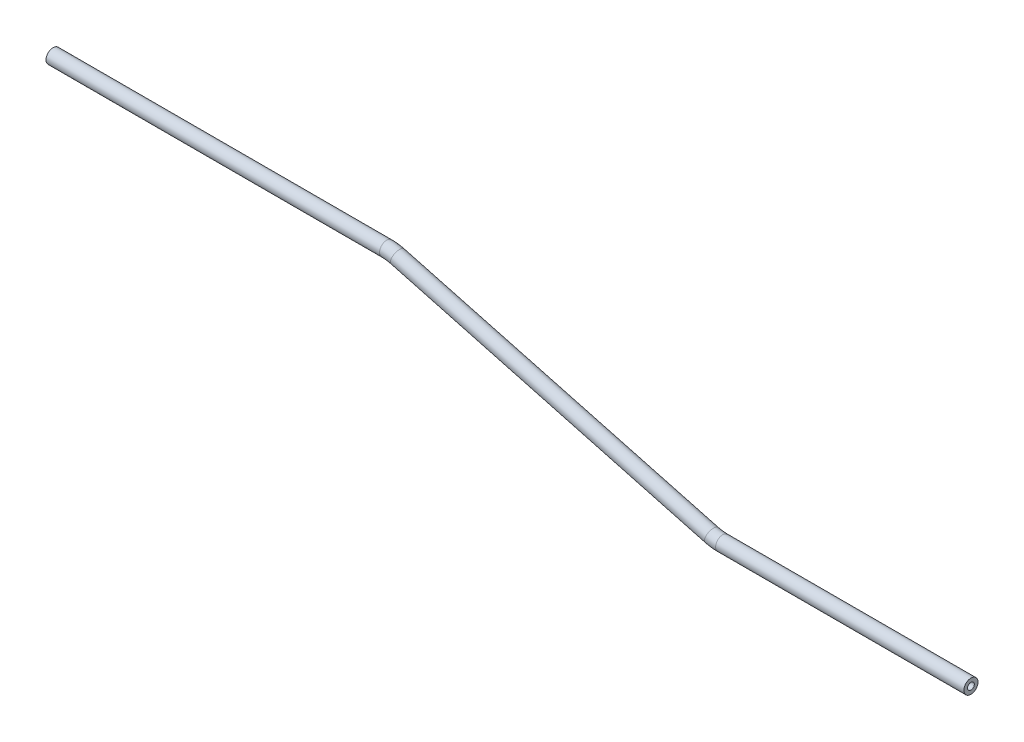
ISO-10303-21;
HEADER;
FILE_DESCRIPTION(('STEP AP214'),'2;1');
FILE_NAME('part.step','',(''),(''),'','','');
FILE_SCHEMA(('AUTOMOTIVE_DESIGN { 1 0 10303 214 1 1 1 1 }'));
ENDSEC;
DATA;
#1=APPLICATION_CONTEXT('core data for automotive mechanical design processes');
#2=APPLICATION_PROTOCOL_DEFINITION('international standard','automotive_design',2000,#1);
#3=PRODUCT_CONTEXT('',#1,'mechanical');
#4=PRODUCT('Part','Part','',(#3));
#5=PRODUCT_RELATED_PRODUCT_CATEGORY('part','',(#4));
#6=PRODUCT_DEFINITION_FORMATION('','',#4);
#7=PRODUCT_DEFINITION_CONTEXT('part definition',#1,'design');
#8=PRODUCT_DEFINITION('design','',#6,#7);
#9=PRODUCT_DEFINITION_SHAPE('','',#8);
#10=(LENGTH_UNIT() NAMED_UNIT(*) SI_UNIT(.MILLI.,.METRE.));
#11=(NAMED_UNIT(*) PLANE_ANGLE_UNIT() SI_UNIT($,.RADIAN.));
#12=(NAMED_UNIT(*) SI_UNIT($,.STERADIAN.) SOLID_ANGLE_UNIT());
#13=UNCERTAINTY_MEASURE_WITH_UNIT(LENGTH_MEASURE(1.E-05),#10,'distance_accuracy_value','');
#14=(GEOMETRIC_REPRESENTATION_CONTEXT(3) GLOBAL_UNCERTAINTY_ASSIGNED_CONTEXT((#13)) GLOBAL_UNIT_ASSIGNED_CONTEXT((#10,
#11,#12)) REPRESENTATION_CONTEXT('',''));
#15=CARTESIAN_POINT('',(0.,0.,0.));
#16=DIRECTION('',(0.,0.,1.));
#17=DIRECTION('',(1.,0.,0.));
#18=AXIS2_PLACEMENT_3D('',#15,#16,#17);
#19=CARTESIAN_POINT('',(-134.955757404131,7.1637583532924,0.));
#20=DIRECTION('',(1.,0.,0.));
#21=DIRECTION('',(0.,1.,0.));
#22=AXIS2_PLACEMENT_3D('',#19,#20,#21);
#23=CYLINDRICAL_SURFACE('',#22,3.175);
#24=CARTESIAN_POINT('',(14.9362625168288,7.16375835329244,0.));
#25=DIRECTION('',(1.,0.,0.));
#26=DIRECTION('',(0.,1.,0.));
#27=AXIS2_PLACEMENT_3D('',#24,#25,#26);
#28=CIRCLE('',#27,3.175);
#29=CARTESIAN_POINT('',(14.9362625168288,10.3387583532924,0.));
#30=VERTEX_POINT('',#29);
#31=EDGE_CURVE('E54',#30,#30,#28,.T.);
#32=ORIENTED_EDGE('',*,*,#31,.F.);
#33=EDGE_LOOP('',(#32));
#34=FACE_BOUND('',#33,.T.);
#35=CARTESIAN_POINT('',(-134.955757404131,7.1637583532924,0.));
#36=DIRECTION('',(1.,0.,0.));
#37=DIRECTION('',(0.,1.,0.));
#38=AXIS2_PLACEMENT_3D('',#35,#36,#37);
#39=CIRCLE('',#38,3.175);
#40=CARTESIAN_POINT('',(-134.955757404131,10.3387583532924,0.));
#41=VERTEX_POINT('',#40);
#42=EDGE_CURVE('E51',#41,#41,#39,.T.);
#43=ORIENTED_EDGE('',*,*,#42,.T.);
#44=EDGE_LOOP('',(#43));
#45=FACE_BOUND('',#44,.T.);
#46=ADVANCED_FACE('F30',(#34,#45),#23,.T.);
#47=CARTESIAN_POINT('',(14.9362625168288,-11.8862416467076,0.));
#48=DIRECTION('',(0.,0.,-1.));
#49=DIRECTION('',(-1.,0.,0.));
#50=AXIS2_PLACEMENT_3D('',#47,#48,#49);
#51=TOROIDAL_SURFACE('',#50,19.05,3.175);
#52=CARTESIAN_POINT('',(19.8667653260318,6.51464534409918,0.));
#53=DIRECTION('',(0.965925826289068,-0.258819045102521,0.));
#54=DIRECTION('',(0.258819045102521,0.965925826289068,0.));
#55=AXIS2_PLACEMENT_3D('',#52,#53,#54);
#56=CIRCLE('',#55,3.175);
#57=CARTESIAN_POINT('',(20.6885157942323,9.58145984256696,0.));
#58=VERTEX_POINT('',#57);
#59=EDGE_CURVE('E57',#58,#58,#56,.T.);
#60=CARTESIAN_POINT('',(14.9362625168288,-11.8862416467076,0.));
#61=DIRECTION('',(0.,0.,-1.));
#62=DIRECTION('',(-1.,0.,0.));
#63=AXIS2_PLACEMENT_3D('',#60,#61,#62);
#64=CIRCLE('',#63,22.225);
#65=EDGE_CURVE('',#30,#58,#64,.T.);
#66=ORIENTED_EDGE('',*,*,#31,.T.);
#67=ORIENTED_EDGE('',*,*,#59,.F.);
#68=ORIENTED_EDGE('',*,*,#65,.T.);
#69=ORIENTED_EDGE('',*,*,#65,.F.);
#70=EDGE_LOOP('',(#66,#68,#67,#69));
#71=FACE_BOUND('',#70,.T.);
#72=ADVANCED_FACE('F76',(#71),#51,.T.);
#73=CARTESIAN_POINT('',(19.8667653260319,6.51464534409919,0.));
#74=DIRECTION('',(0.965925826289068,-0.258819045102521,0.));
#75=DIRECTION('',(0.258819045102521,0.965925826289068,0.));
#76=AXIS2_PLACEMENT_3D('',#73,#74,#75);
#77=CYLINDRICAL_SURFACE('',#76,3.175);
#78=CARTESIAN_POINT('',(161.004543444371,-31.3031083242329,0.));
#79=DIRECTION('',(0.965925826289068,-0.258819045102522,0.));
#80=DIRECTION('',(0.258819045102522,0.965925826289068,0.));
#81=AXIS2_PLACEMENT_3D('',#78,#79,#80);
#82=CIRCLE('',#81,3.175);
#83=CARTESIAN_POINT('',(160.18279297617,-34.3699228227007,0.));
#84=VERTEX_POINT('',#83);
#85=EDGE_CURVE('E59',#84,#84,#82,.T.);
#86=ORIENTED_EDGE('',*,*,#85,.F.);
#87=EDGE_LOOP('',(#86));
#88=FACE_BOUND('',#87,.T.);
#89=ORIENTED_EDGE('',*,*,#59,.T.);
#90=EDGE_LOOP('',(#89));
#91=FACE_BOUND('',#90,.T.);
#92=ADVANCED_FACE('F69',(#88,#91),#77,.T.);
#93=CARTESIAN_POINT('',(165.935046253574,-12.9022213334261,0.));
#94=DIRECTION('',(0.,0.,1.));
#95=DIRECTION('',(1.,0.,0.));
#96=AXIS2_PLACEMENT_3D('',#93,#94,#95);
#97=TOROIDAL_SURFACE('',#96,19.05,3.175);
#98=CARTESIAN_POINT('',(165.935046253574,-31.9522213334261,0.));
#99=DIRECTION('',(1.,0.,0.));
#100=DIRECTION('',(0.,1.,0.));
#101=AXIS2_PLACEMENT_3D('',#98,#99,#100);
#102=CIRCLE('',#101,3.175);
#103=CARTESIAN_POINT('',(165.935046253574,-35.1272213334261,0.));
#104=VERTEX_POINT('',#103);
#105=EDGE_CURVE('E34',#104,#104,#102,.T.);
#106=CARTESIAN_POINT('',(165.935046253574,-12.9022213334261,0.));
#107=DIRECTION('',(0.,0.,1.));
#108=DIRECTION('',(1.,0.,0.));
#109=AXIS2_PLACEMENT_3D('',#106,#107,#108);
#110=CIRCLE('',#109,22.225);
#111=EDGE_CURVE('',#84,#104,#110,.T.);
#112=ORIENTED_EDGE('',*,*,#85,.T.);
#113=ORIENTED_EDGE('',*,*,#105,.F.);
#114=ORIENTED_EDGE('',*,*,#111,.T.);
#115=ORIENTED_EDGE('',*,*,#111,.F.);
#116=EDGE_LOOP('',(#112,#114,#113,#115));
#117=FACE_BOUND('',#116,.T.);
#118=ADVANCED_FACE('F67',(#117),#97,.T.);
#119=CARTESIAN_POINT('',(165.935046253574,-31.9522213334262,0.));
#120=DIRECTION('',(1.,0.,0.));
#121=DIRECTION('',(0.,1.,0.));
#122=AXIS2_PLACEMENT_3D('',#119,#120,#121);
#123=CYLINDRICAL_SURFACE('',#122,3.175);
#124=CARTESIAN_POINT('',(277.481143374534,-31.9522213334262,0.));
#125=DIRECTION('',(1.,0.,0.));
#126=DIRECTION('',(0.,1.,0.));
#127=AXIS2_PLACEMENT_3D('',#124,#125,#126);
#128=CIRCLE('',#127,3.175);
#129=CARTESIAN_POINT('',(277.481143374534,-28.7772213334262,0.));
#130=VERTEX_POINT('',#129);
#131=EDGE_CURVE('E47',#130,#130,#128,.T.);
#132=ORIENTED_EDGE('',*,*,#131,.F.);
#133=EDGE_LOOP('',(#132));
#134=FACE_BOUND('',#133,.T.);
#135=ORIENTED_EDGE('',*,*,#105,.T.);
#136=EDGE_LOOP('',(#135));
#137=FACE_BOUND('',#136,.T.);
#138=ADVANCED_FACE('F32',(#134,#137),#123,.T.);
#139=CARTESIAN_POINT('',(-134.955757404131,7.1637583532924,0.));
#140=DIRECTION('',(1.,0.,0.));
#141=DIRECTION('',(0.,1.,0.));
#142=AXIS2_PLACEMENT_3D('',#139,#140,#141);
#143=PLANE('',#142);
#144=CARTESIAN_POINT('',(-134.955757404131,7.1637583532924,0.));
#145=DIRECTION('',(1.,0.,0.));
#146=DIRECTION('',(0.,1.,0.));
#147=AXIS2_PLACEMENT_3D('',#144,#145,#146);
#148=CIRCLE('',#147,1.524);
#149=CARTESIAN_POINT('',(-134.955757404131,8.6877583532924,0.));
#150=VERTEX_POINT('',#149);
#151=EDGE_CURVE('E50',#150,#150,#148,.F.);
#152=ORIENTED_EDGE('',*,*,#151,.F.);
#153=EDGE_LOOP('',(#152));
#154=FACE_BOUND('',#153,.T.);
#155=ORIENTED_EDGE('',*,*,#42,.F.);
#156=EDGE_LOOP('',(#155));
#157=FACE_BOUND('',#156,.T.);
#158=ADVANCED_FACE('F74',(#154,#157),#143,.F.);
#159=CARTESIAN_POINT('',(277.481143374534,-31.9522213334262,0.));
#160=DIRECTION('',(1.,0.,0.));
#161=DIRECTION('',(0.,1.,0.));
#162=AXIS2_PLACEMENT_3D('',#159,#160,#161);
#163=PLANE('',#162);
#164=CARTESIAN_POINT('',(277.481143374534,-31.9522213334262,0.));
#165=DIRECTION('',(1.,0.,0.));
#166=DIRECTION('',(0.,1.,0.));
#167=AXIS2_PLACEMENT_3D('',#164,#165,#166);
#168=CIRCLE('',#167,1.524);
#169=CARTESIAN_POINT('',(277.481143374534,-30.4282213334262,0.));
#170=VERTEX_POINT('',#169);
#171=EDGE_CURVE('E10',#170,#170,#168,.F.);
#172=ORIENTED_EDGE('',*,*,#171,.T.);
#173=EDGE_LOOP('',(#172));
#174=FACE_BOUND('',#173,.T.);
#175=ORIENTED_EDGE('',*,*,#131,.T.);
#176=EDGE_LOOP('',(#175));
#177=FACE_BOUND('',#176,.T.);
#178=ADVANCED_FACE('F93',(#174,#177),#163,.T.);
#179=CARTESIAN_POINT('',(-134.955757404131,7.1637583532924,0.));
#180=DIRECTION('',(1.,0.,0.));
#181=DIRECTION('',(0.,1.,0.));
#182=AXIS2_PLACEMENT_3D('',#179,#180,#181);
#183=CYLINDRICAL_SURFACE('',#182,1.524);
#184=CARTESIAN_POINT('',(14.9362625168288,7.16375835329244,0.));
#185=DIRECTION('',(1.,0.,0.));
#186=DIRECTION('',(0.,1.,0.));
#187=AXIS2_PLACEMENT_3D('',#184,#185,#186);
#188=CIRCLE('',#187,1.524);
#189=CARTESIAN_POINT('',(14.9362625168288,8.68775835329241,0.));
#190=VERTEX_POINT('',#189);
#191=EDGE_CURVE('E189',#190,#190,#188,.F.);
#192=ORIENTED_EDGE('',*,*,#191,.F.);
#193=EDGE_LOOP('',(#192));
#194=FACE_BOUND('',#193,.T.);
#195=ORIENTED_EDGE('',*,*,#151,.T.);
#196=EDGE_LOOP('',(#195));
#197=FACE_BOUND('',#196,.T.);
#198=ADVANCED_FACE('F96',(#194,#197),#183,.F.);
#199=CARTESIAN_POINT('',(14.9362625168288,-11.8862416467076,0.));
#200=DIRECTION('',(0.,0.,-1.));
#201=DIRECTION('',(-1.,0.,0.));
#202=AXIS2_PLACEMENT_3D('',#199,#200,#201);
#203=TOROIDAL_SURFACE('',#202,19.05,1.524);
#204=CARTESIAN_POINT('',(19.8667653260318,6.51464534409918,0.));
#205=DIRECTION('',(0.965925826289068,-0.258819045102521,0.));
#206=DIRECTION('',(0.258819045102521,0.965925826289068,0.));
#207=AXIS2_PLACEMENT_3D('',#204,#205,#206);
#208=CIRCLE('',#207,1.524);
#209=CARTESIAN_POINT('',(20.2612055507681,7.98671630336371,0.));
#210=VERTEX_POINT('',#209);
#211=EDGE_CURVE('E188',#210,#210,#208,.F.);
#212=CARTESIAN_POINT('',(14.9362625168288,-11.8862416467076,0.));
#213=DIRECTION('',(0.,0.,-1.));
#214=DIRECTION('',(-1.,0.,0.));
#215=AXIS2_PLACEMENT_3D('',#212,#213,#214);
#216=CIRCLE('',#215,20.574);
#217=EDGE_CURVE('',#190,#210,#216,.T.);
#218=ORIENTED_EDGE('',*,*,#191,.T.);
#219=ORIENTED_EDGE('',*,*,#211,.F.);
#220=ORIENTED_EDGE('',*,*,#217,.T.);
#221=ORIENTED_EDGE('',*,*,#217,.F.);
#222=EDGE_LOOP('',(#218,#220,#219,#221));
#223=FACE_BOUND('',#222,.T.);
#224=ADVANCED_FACE('F151',(#223),#203,.F.);
#225=CARTESIAN_POINT('',(19.8667653260319,6.51464534409919,0.));
#226=DIRECTION('',(0.965925826289068,-0.258819045102521,0.));
#227=DIRECTION('',(0.258819045102521,0.965925826289068,0.));
#228=AXIS2_PLACEMENT_3D('',#225,#226,#227);
#229=CYLINDRICAL_SURFACE('',#228,1.524);
#230=CARTESIAN_POINT('',(161.004543444371,-31.3031083242329,0.));
#231=DIRECTION('',(0.965925826289068,-0.258819045102522,0.));
#232=DIRECTION('',(0.258819045102522,0.965925826289068,0.));
#233=AXIS2_PLACEMENT_3D('',#230,#231,#232);
#234=CIRCLE('',#233,1.524);
#235=CARTESIAN_POINT('',(160.610103219635,-32.7751792834974,0.));
#236=VERTEX_POINT('',#235);
#237=EDGE_CURVE('E43',#236,#236,#234,.F.);
#238=ORIENTED_EDGE('',*,*,#237,.F.);
#239=EDGE_LOOP('',(#238));
#240=FACE_BOUND('',#239,.T.);
#241=ORIENTED_EDGE('',*,*,#211,.T.);
#242=EDGE_LOOP('',(#241));
#243=FACE_BOUND('',#242,.T.);
#244=ADVANCED_FACE('F87',(#240,#243),#229,.F.);
#245=CARTESIAN_POINT('',(165.935046253574,-12.9022213334261,0.));
#246=DIRECTION('',(0.,0.,1.));
#247=DIRECTION('',(1.,0.,0.));
#248=AXIS2_PLACEMENT_3D('',#245,#246,#247);
#249=TOROIDAL_SURFACE('',#248,19.05,1.524);
#250=CARTESIAN_POINT('',(165.935046253574,-31.9522213334261,0.));
#251=DIRECTION('',(1.,0.,0.));
#252=DIRECTION('',(0.,1.,0.));
#253=AXIS2_PLACEMENT_3D('',#250,#251,#252);
#254=CIRCLE('',#253,1.524);
#255=CARTESIAN_POINT('',(165.935046253574,-33.4762213334261,0.));
#256=VERTEX_POINT('',#255);
#257=EDGE_CURVE('E38',#256,#256,#254,.F.);
#258=CARTESIAN_POINT('',(165.935046253574,-12.9022213334261,0.));
#259=DIRECTION('',(0.,0.,1.));
#260=DIRECTION('',(1.,0.,0.));
#261=AXIS2_PLACEMENT_3D('',#258,#259,#260);
#262=CIRCLE('',#261,20.574);
#263=EDGE_CURVE('',#236,#256,#262,.T.);
#264=ORIENTED_EDGE('',*,*,#237,.T.);
#265=ORIENTED_EDGE('',*,*,#257,.F.);
#266=ORIENTED_EDGE('',*,*,#263,.T.);
#267=ORIENTED_EDGE('',*,*,#263,.F.);
#268=EDGE_LOOP('',(#264,#266,#265,#267));
#269=FACE_BOUND('',#268,.T.);
#270=ADVANCED_FACE('F81',(#269),#249,.F.);
#271=CARTESIAN_POINT('',(165.935046253574,-31.9522213334262,0.));
#272=DIRECTION('',(1.,0.,0.));
#273=DIRECTION('',(0.,1.,0.));
#274=AXIS2_PLACEMENT_3D('',#271,#272,#273);
#275=CYLINDRICAL_SURFACE('',#274,1.524);
#276=ORIENTED_EDGE('',*,*,#171,.F.);
#277=EDGE_LOOP('',(#276));
#278=FACE_BOUND('',#277,.T.);
#279=ORIENTED_EDGE('',*,*,#257,.T.);
#280=EDGE_LOOP('',(#279));
#281=FACE_BOUND('',#280,.T.);
#282=ADVANCED_FACE('F79',(#278,#281),#275,.F.);
#283=CLOSED_SHELL('',(#46,#72,#92,#118,#138,#158,#178,#198,#224,#244,#270,#282));
#284=MANIFOLD_SOLID_BREP('B2',#283);
#285=ADVANCED_BREP_SHAPE_REPRESENTATION('',(#18,#284),#14);
#286=SHAPE_DEFINITION_REPRESENTATION(#9,#285);
ENDSEC;
END-ISO-10303-21;
